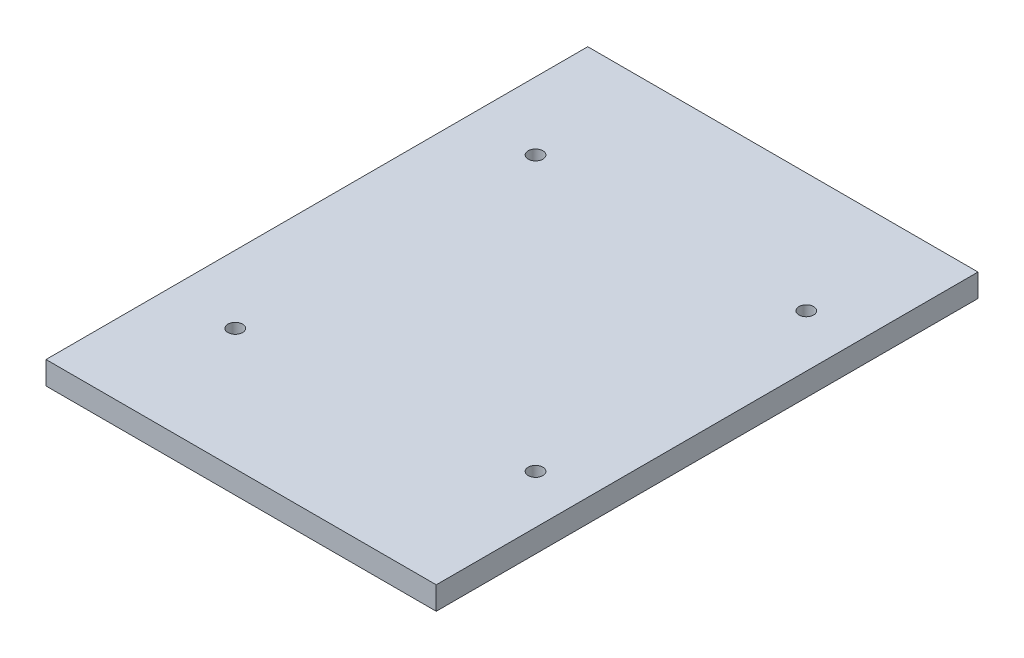
ISO-10303-21;
HEADER;
FILE_DESCRIPTION(('STEP AP214'),'2;1');
FILE_NAME('part.step','',(''),(''),'','','');
FILE_SCHEMA(('AUTOMOTIVE_DESIGN { 1 0 10303 214 1 1 1 1 }'));
ENDSEC;
DATA;
#1=APPLICATION_CONTEXT('core data for automotive mechanical design processes');
#2=APPLICATION_PROTOCOL_DEFINITION('international standard','automotive_design',2000,#1);
#3=PRODUCT_CONTEXT('',#1,'mechanical');
#4=PRODUCT('Part','Part','',(#3));
#5=PRODUCT_RELATED_PRODUCT_CATEGORY('part','',(#4));
#6=PRODUCT_DEFINITION_FORMATION('','',#4);
#7=PRODUCT_DEFINITION_CONTEXT('part definition',#1,'design');
#8=PRODUCT_DEFINITION('design','',#6,#7);
#9=PRODUCT_DEFINITION_SHAPE('','',#8);
#10=(LENGTH_UNIT() NAMED_UNIT(*) SI_UNIT(.MILLI.,.METRE.));
#11=(NAMED_UNIT(*) PLANE_ANGLE_UNIT() SI_UNIT($,.RADIAN.));
#12=(NAMED_UNIT(*) SI_UNIT($,.STERADIAN.) SOLID_ANGLE_UNIT());
#13=UNCERTAINTY_MEASURE_WITH_UNIT(LENGTH_MEASURE(1.E-05),#10,'distance_accuracy_value','');
#14=(GEOMETRIC_REPRESENTATION_CONTEXT(3) GLOBAL_UNCERTAINTY_ASSIGNED_CONTEXT((#13)) GLOBAL_UNIT_ASSIGNED_CONTEXT((#10,
#11,#12)) REPRESENTATION_CONTEXT('',''));
#15=CARTESIAN_POINT('',(0.,0.,0.));
#16=DIRECTION('',(0.,0.,1.));
#17=DIRECTION('',(1.,0.,0.));
#18=AXIS2_PLACEMENT_3D('',#15,#16,#17);
#19=CARTESIAN_POINT('',(-48.875,0.,0.));
#20=DIRECTION('',(1.,0.,0.));
#21=DIRECTION('',(0.,0.,-1.));
#22=AXIS2_PLACEMENT_3D('',#19,#20,#21);
#23=PLANE('',#22);
#24=DIRECTION('',(0.,-1.,0.));
#25=VECTOR('',#24,1.);
#26=CARTESIAN_POINT('',(-48.875,5.,-55.5));
#27=LINE('',#26,#25);
#28=CARTESIAN_POINT('',(-48.875,5.,-55.5));
#29=VERTEX_POINT('',#28);
#30=CARTESIAN_POINT('',(-48.875,0.,-55.5));
#31=VERTEX_POINT('',#30);
#32=EDGE_CURVE('E72',#29,#31,#27,.T.);
#33=ORIENTED_EDGE('',*,*,#32,.F.);
#34=DIRECTION('',(0.,0.,-1.));
#35=VECTOR('',#34,1.);
#36=CARTESIAN_POINT('',(-48.875,5.,0.));
#37=LINE('',#36,#35);
#38=CARTESIAN_POINT('',(-48.875,5.,62.5));
#39=VERTEX_POINT('',#38);
#40=EDGE_CURVE('E92',#39,#29,#37,.T.);
#41=ORIENTED_EDGE('',*,*,#40,.F.);
#42=DIRECTION('',(0.,-1.,0.));
#43=VECTOR('',#42,1.);
#44=CARTESIAN_POINT('',(-48.875,5.,62.5));
#45=LINE('',#44,#43);
#46=CARTESIAN_POINT('',(-48.875,0.,62.5));
#47=VERTEX_POINT('',#46);
#48=EDGE_CURVE('E84',#39,#47,#45,.T.);
#49=ORIENTED_EDGE('',*,*,#48,.T.);
#50=DIRECTION('',(0.,0.,-1.));
#51=VECTOR('',#50,1.);
#52=CARTESIAN_POINT('',(-48.875,0.,0.));
#53=LINE('',#52,#51);
#54=EDGE_CURVE('E89',#47,#31,#53,.T.);
#55=ORIENTED_EDGE('',*,*,#54,.T.);
#56=EDGE_LOOP('',(#33,#41,#49,#55));
#57=FACE_BOUND('',#56,.T.);
#58=ADVANCED_FACE('F35',(#57),#23,.T.);
#59=CARTESIAN_POINT('',(0.,5.,0.));
#60=DIRECTION('',(0.,1.,0.));
#61=DIRECTION('',(0.,0.,1.));
#62=AXIS2_PLACEMENT_3D('',#59,#60,#61);
#63=PLANE('',#62);
#64=CARTESIAN_POINT('',(-119.139988314674,5.,36.013));
#65=DIRECTION('',(0.,1.,0.));
#66=DIRECTION('',(0.,0.,1.));
#67=AXIS2_PLACEMENT_3D('',#64,#65,#66);
#68=CIRCLE('',#67,1.59999999999999);
#69=CARTESIAN_POINT('',(-119.139988314674,5.,37.613));
#70=VERTEX_POINT('',#69);
#71=EDGE_CURVE('E222',#70,#70,#68,.T.);
#72=ORIENTED_EDGE('',*,*,#71,.F.);
#73=EDGE_LOOP('',(#72));
#74=FACE_BOUND('',#73,.T.);
#75=CARTESIAN_POINT('',(-119.139988314674,5.,-29.392));
#76=DIRECTION('',(0.,1.,0.));
#77=DIRECTION('',(0.,0.,1.));
#78=AXIS2_PLACEMENT_3D('',#75,#76,#77);
#79=CIRCLE('',#78,1.6);
#80=CARTESIAN_POINT('',(-119.139988314674,5.,-27.792));
#81=VERTEX_POINT('',#80);
#82=EDGE_CURVE('E225',#81,#81,#79,.T.);
#83=ORIENTED_EDGE('',*,*,#82,.F.);
#84=EDGE_LOOP('',(#83));
#85=FACE_BOUND('',#84,.T.);
#86=CARTESIAN_POINT('',(-60.2619883146741,5.,-29.4860000000002));
#87=DIRECTION('',(0.,1.,0.));
#88=DIRECTION('',(0.,0.,1.));
#89=AXIS2_PLACEMENT_3D('',#86,#87,#88);
#90=CIRCLE('',#89,1.6);
#91=CARTESIAN_POINT('',(-60.2619883146741,5.,-27.8860000000002));
#92=VERTEX_POINT('',#91);
#93=EDGE_CURVE('E228',#92,#92,#90,.T.);
#94=ORIENTED_EDGE('',*,*,#93,.F.);
#95=EDGE_LOOP('',(#94));
#96=FACE_BOUND('',#95,.T.);
#97=CARTESIAN_POINT('',(-59.4499883146739,5.,30.2979999999998));
#98=DIRECTION('',(0.,1.,0.));
#99=DIRECTION('',(0.,0.,1.));
#100=AXIS2_PLACEMENT_3D('',#97,#98,#99);
#101=CIRCLE('',#100,1.6);
#102=CARTESIAN_POINT('',(-59.4499883146739,5.,31.8979999999998));
#103=VERTEX_POINT('',#102);
#104=EDGE_CURVE('E101',#103,#103,#101,.T.);
#105=ORIENTED_EDGE('',*,*,#104,.F.);
#106=EDGE_LOOP('',(#105));
#107=FACE_BOUND('',#106,.T.);
#108=DIRECTION('',(1.,0.,0.));
#109=VECTOR('',#108,1.);
#110=CARTESIAN_POINT('',(0.,5.,62.5));
#111=LINE('',#110,#109);
#112=CARTESIAN_POINT('',(-133.875,5.,62.5));
#113=VERTEX_POINT('',#112);
#114=EDGE_CURVE('E64',#113,#39,#111,.T.);
#115=ORIENTED_EDGE('',*,*,#114,.T.);
#116=ORIENTED_EDGE('',*,*,#40,.T.);
#117=DIRECTION('',(1.,0.,0.));
#118=VECTOR('',#117,1.);
#119=CARTESIAN_POINT('',(0.,5.,-55.5));
#120=LINE('',#119,#118);
#121=CARTESIAN_POINT('',(-133.875,5.,-55.5));
#122=VERTEX_POINT('',#121);
#123=EDGE_CURVE('E102',#122,#29,#120,.T.);
#124=ORIENTED_EDGE('',*,*,#123,.F.);
#125=DIRECTION('',(0.,0.,1.));
#126=VECTOR('',#125,1.);
#127=CARTESIAN_POINT('',(-133.875,5.,0.));
#128=LINE('',#127,#126);
#129=EDGE_CURVE('E100',#122,#113,#128,.T.);
#130=ORIENTED_EDGE('',*,*,#129,.T.);
#131=EDGE_LOOP('',(#115,#116,#124,#130));
#132=FACE_BOUND('',#131,.T.);
#133=ADVANCED_FACE('F113',(#74,#85,#96,#107,#132),#63,.T.);
#134=CARTESIAN_POINT('',(0.,0.,0.));
#135=DIRECTION('',(0.,1.,0.));
#136=DIRECTION('',(0.,0.,1.));
#137=AXIS2_PLACEMENT_3D('',#134,#135,#136);
#138=PLANE('',#137);
#139=CARTESIAN_POINT('',(-59.4499883146739,0.,30.2979999999998));
#140=DIRECTION('',(0.,1.,0.));
#141=DIRECTION('',(0.,0.,1.));
#142=AXIS2_PLACEMENT_3D('',#139,#140,#141);
#143=CIRCLE('',#142,1.6);
#144=CARTESIAN_POINT('',(-59.4499883146739,0.,31.8979999999998));
#145=VERTEX_POINT('',#144);
#146=EDGE_CURVE('E88',#145,#145,#143,.T.);
#147=ORIENTED_EDGE('',*,*,#146,.T.);
#148=EDGE_LOOP('',(#147));
#149=FACE_BOUND('',#148,.T.);
#150=CARTESIAN_POINT('',(-60.2619883146741,0.,-29.4860000000002));
#151=DIRECTION('',(0.,1.,0.));
#152=DIRECTION('',(0.,0.,1.));
#153=AXIS2_PLACEMENT_3D('',#150,#151,#152);
#154=CIRCLE('',#153,1.6);
#155=CARTESIAN_POINT('',(-60.2619883146741,0.,-27.8860000000002));
#156=VERTEX_POINT('',#155);
#157=EDGE_CURVE('E241',#156,#156,#154,.T.);
#158=ORIENTED_EDGE('',*,*,#157,.T.);
#159=EDGE_LOOP('',(#158));
#160=FACE_BOUND('',#159,.T.);
#161=CARTESIAN_POINT('',(-119.139988314674,0.,-29.392));
#162=DIRECTION('',(0.,1.,0.));
#163=DIRECTION('',(0.,0.,1.));
#164=AXIS2_PLACEMENT_3D('',#161,#162,#163);
#165=CIRCLE('',#164,1.6);
#166=CARTESIAN_POINT('',(-119.139988314674,0.,-27.792));
#167=VERTEX_POINT('',#166);
#168=EDGE_CURVE('E106',#167,#167,#165,.T.);
#169=ORIENTED_EDGE('',*,*,#168,.T.);
#170=EDGE_LOOP('',(#169));
#171=FACE_BOUND('',#170,.T.);
#172=CARTESIAN_POINT('',(-119.139988314674,0.,36.013));
#173=DIRECTION('',(0.,1.,0.));
#174=DIRECTION('',(0.,0.,1.));
#175=AXIS2_PLACEMENT_3D('',#172,#173,#174);
#176=CIRCLE('',#175,1.59999999999999);
#177=CARTESIAN_POINT('',(-119.139988314674,0.,37.613));
#178=VERTEX_POINT('',#177);
#179=EDGE_CURVE('E103',#178,#178,#176,.T.);
#180=ORIENTED_EDGE('',*,*,#179,.T.);
#181=EDGE_LOOP('',(#180));
#182=FACE_BOUND('',#181,.T.);
#183=ORIENTED_EDGE('',*,*,#54,.F.);
#184=DIRECTION('',(1.,0.,0.));
#185=VECTOR('',#184,1.);
#186=CARTESIAN_POINT('',(0.,0.,62.5));
#187=LINE('',#186,#185);
#188=CARTESIAN_POINT('',(-133.875,0.,62.5));
#189=VERTEX_POINT('',#188);
#190=EDGE_CURVE('E80',#189,#47,#187,.T.);
#191=ORIENTED_EDGE('',*,*,#190,.F.);
#192=DIRECTION('',(0.,0.,1.));
#193=VECTOR('',#192,1.);
#194=CARTESIAN_POINT('',(-133.875,0.,0.));
#195=LINE('',#194,#193);
#196=CARTESIAN_POINT('',(-133.875,0.,-55.5));
#197=VERTEX_POINT('',#196);
#198=EDGE_CURVE('E44',#197,#189,#195,.T.);
#199=ORIENTED_EDGE('',*,*,#198,.F.);
#200=DIRECTION('',(1.,0.,0.));
#201=VECTOR('',#200,1.);
#202=CARTESIAN_POINT('',(0.,0.,-55.5));
#203=LINE('',#202,#201);
#204=EDGE_CURVE('E11',#197,#31,#203,.T.);
#205=ORIENTED_EDGE('',*,*,#204,.T.);
#206=EDGE_LOOP('',(#183,#191,#199,#205));
#207=FACE_BOUND('',#206,.T.);
#208=ADVANCED_FACE('F90',(#149,#160,#171,#182,#207),#138,.F.);
#209=CARTESIAN_POINT('',(0.,5.,-55.5));
#210=DIRECTION('',(0.,0.,-1.));
#211=DIRECTION('',(-1.,0.,0.));
#212=AXIS2_PLACEMENT_3D('',#209,#210,#211);
#213=PLANE('',#212);
#214=ORIENTED_EDGE('',*,*,#123,.T.);
#215=ORIENTED_EDGE('',*,*,#32,.T.);
#216=ORIENTED_EDGE('',*,*,#204,.F.);
#217=DIRECTION('',(0.,-1.,0.));
#218=VECTOR('',#217,1.);
#219=CARTESIAN_POINT('',(-133.875,5.,-55.5));
#220=LINE('',#219,#218);
#221=EDGE_CURVE('E52',#122,#197,#220,.T.);
#222=ORIENTED_EDGE('',*,*,#221,.F.);
#223=EDGE_LOOP('',(#214,#215,#216,#222));
#224=FACE_BOUND('',#223,.T.);
#225=ADVANCED_FACE('F37',(#224),#213,.T.);
#226=CARTESIAN_POINT('',(0.,5.,62.5));
#227=DIRECTION('',(0.,0.,-1.));
#228=DIRECTION('',(-1.,0.,0.));
#229=AXIS2_PLACEMENT_3D('',#226,#227,#228);
#230=PLANE('',#229);
#231=ORIENTED_EDGE('',*,*,#48,.F.);
#232=ORIENTED_EDGE('',*,*,#114,.F.);
#233=DIRECTION('',(0.,-1.,0.));
#234=VECTOR('',#233,1.);
#235=CARTESIAN_POINT('',(-133.875,5.,62.5));
#236=LINE('',#235,#234);
#237=EDGE_CURVE('E86',#113,#189,#236,.T.);
#238=ORIENTED_EDGE('',*,*,#237,.T.);
#239=ORIENTED_EDGE('',*,*,#190,.T.);
#240=EDGE_LOOP('',(#231,#232,#238,#239));
#241=FACE_BOUND('',#240,.T.);
#242=ADVANCED_FACE('F82',(#241),#230,.F.);
#243=CARTESIAN_POINT('',(-133.875,5.,0.));
#244=DIRECTION('',(1.,0.,0.));
#245=DIRECTION('',(0.,0.,-1.));
#246=AXIS2_PLACEMENT_3D('',#243,#244,#245);
#247=PLANE('',#246);
#248=ORIENTED_EDGE('',*,*,#198,.T.);
#249=ORIENTED_EDGE('',*,*,#237,.F.);
#250=ORIENTED_EDGE('',*,*,#129,.F.);
#251=ORIENTED_EDGE('',*,*,#221,.T.);
#252=EDGE_LOOP('',(#248,#249,#250,#251));
#253=FACE_BOUND('',#252,.T.);
#254=ADVANCED_FACE('F128',(#253),#247,.F.);
#255=CARTESIAN_POINT('',(-119.139988314674,5.,-29.392));
#256=DIRECTION('',(0.,-1.,0.));
#257=DIRECTION('',(0.,0.,-1.));
#258=AXIS2_PLACEMENT_3D('',#255,#256,#257);
#259=CYLINDRICAL_SURFACE('',#258,1.6);
#260=ORIENTED_EDGE('',*,*,#82,.T.);
#261=EDGE_LOOP('',(#260));
#262=FACE_BOUND('',#261,.T.);
#263=ORIENTED_EDGE('',*,*,#168,.F.);
#264=EDGE_LOOP('',(#263));
#265=FACE_BOUND('',#264,.T.);
#266=ADVANCED_FACE('F133',(#262,#265),#259,.F.);
#267=CARTESIAN_POINT('',(-60.2619883146741,5.,-29.4860000000002));
#268=DIRECTION('',(0.,-1.,0.));
#269=DIRECTION('',(0.,0.,-1.));
#270=AXIS2_PLACEMENT_3D('',#267,#268,#269);
#271=CYLINDRICAL_SURFACE('',#270,1.6);
#272=ORIENTED_EDGE('',*,*,#93,.T.);
#273=EDGE_LOOP('',(#272));
#274=FACE_BOUND('',#273,.T.);
#275=ORIENTED_EDGE('',*,*,#157,.F.);
#276=EDGE_LOOP('',(#275));
#277=FACE_BOUND('',#276,.T.);
#278=ADVANCED_FACE('F187',(#274,#277),#271,.F.);
#279=CARTESIAN_POINT('',(-59.4499883146739,5.,30.2979999999998));
#280=DIRECTION('',(0.,-1.,0.));
#281=DIRECTION('',(0.,0.,-1.));
#282=AXIS2_PLACEMENT_3D('',#279,#280,#281);
#283=CYLINDRICAL_SURFACE('',#282,1.6);
#284=ORIENTED_EDGE('',*,*,#104,.T.);
#285=EDGE_LOOP('',(#284));
#286=FACE_BOUND('',#285,.T.);
#287=ORIENTED_EDGE('',*,*,#146,.F.);
#288=EDGE_LOOP('',(#287));
#289=FACE_BOUND('',#288,.T.);
#290=ADVANCED_FACE('F196',(#286,#289),#283,.F.);
#291=CARTESIAN_POINT('',(-119.139988314674,5.,36.013));
#292=DIRECTION('',(0.,-1.,0.));
#293=DIRECTION('',(0.,0.,-1.));
#294=AXIS2_PLACEMENT_3D('',#291,#292,#293);
#295=CYLINDRICAL_SURFACE('',#294,1.59999999999999);
#296=ORIENTED_EDGE('',*,*,#71,.T.);
#297=EDGE_LOOP('',(#296));
#298=FACE_BOUND('',#297,.T.);
#299=ORIENTED_EDGE('',*,*,#179,.F.);
#300=EDGE_LOOP('',(#299));
#301=FACE_BOUND('',#300,.T.);
#302=ADVANCED_FACE('F124',(#298,#301),#295,.F.);
#303=CLOSED_SHELL('',(#58,#133,#208,#225,#242,#254,#266,#278,#290,#302));
#304=MANIFOLD_SOLID_BREP('B2',#303);
#305=ADVANCED_BREP_SHAPE_REPRESENTATION('',(#18,#304),#14);
#306=SHAPE_DEFINITION_REPRESENTATION(#9,#305);
ENDSEC;
END-ISO-10303-21;
